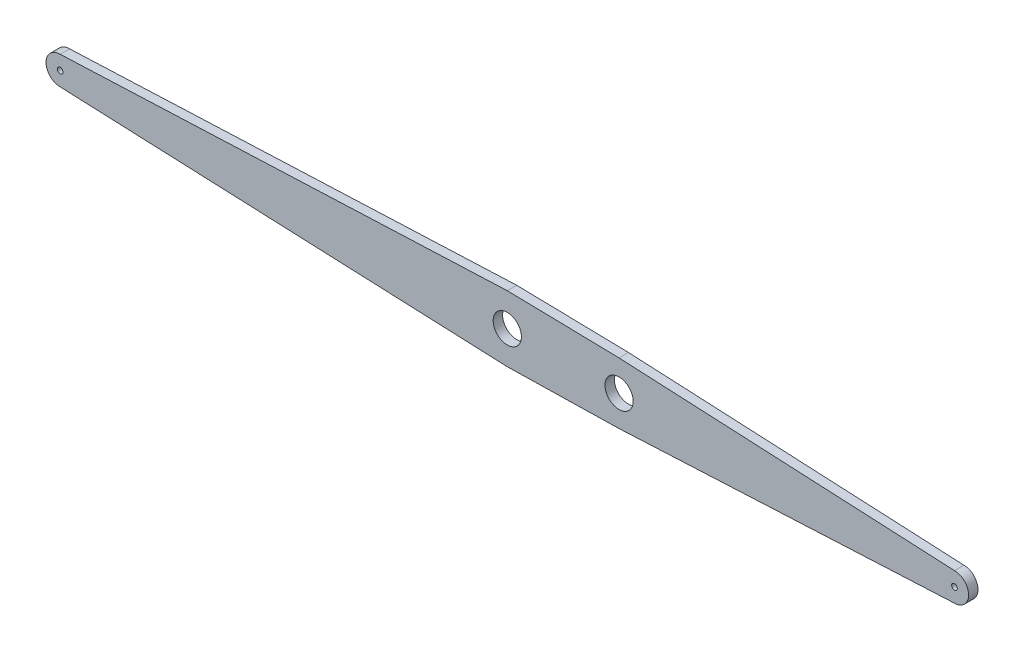
ISO-10303-21;
HEADER;
FILE_DESCRIPTION(('STEP AP214'),'2;1');
FILE_NAME('part.step','',(''),(''),'','','');
FILE_SCHEMA(('AUTOMOTIVE_DESIGN { 1 0 10303 214 1 1 1 1 }'));
ENDSEC;
DATA;
#1=APPLICATION_CONTEXT('core data for automotive mechanical design processes');
#2=APPLICATION_PROTOCOL_DEFINITION('international standard','automotive_design',2000,#1);
#3=PRODUCT_CONTEXT('',#1,'mechanical');
#4=PRODUCT('Part','Part','',(#3));
#5=PRODUCT_RELATED_PRODUCT_CATEGORY('part','',(#4));
#6=PRODUCT_DEFINITION_FORMATION('','',#4);
#7=PRODUCT_DEFINITION_CONTEXT('part definition',#1,'design');
#8=PRODUCT_DEFINITION('design','',#6,#7);
#9=PRODUCT_DEFINITION_SHAPE('','',#8);
#10=(LENGTH_UNIT() NAMED_UNIT(*) SI_UNIT(.MILLI.,.METRE.));
#11=(NAMED_UNIT(*) PLANE_ANGLE_UNIT() SI_UNIT($,.RADIAN.));
#12=(NAMED_UNIT(*) SI_UNIT($,.STERADIAN.) SOLID_ANGLE_UNIT());
#13=UNCERTAINTY_MEASURE_WITH_UNIT(LENGTH_MEASURE(1.E-05),#10,'distance_accuracy_value','');
#14=(GEOMETRIC_REPRESENTATION_CONTEXT(3) GLOBAL_UNCERTAINTY_ASSIGNED_CONTEXT((#13)) GLOBAL_UNIT_ASSIGNED_CONTEXT((#10,
#11,#12)) REPRESENTATION_CONTEXT('',''));
#15=CARTESIAN_POINT('',(0.,0.,0.));
#16=DIRECTION('',(0.,0.,1.));
#17=DIRECTION('',(1.,0.,0.));
#18=AXIS2_PLACEMENT_3D('',#15,#16,#17);
#19=CARTESIAN_POINT('',(0.,0.,20.));
#20=DIRECTION('',(0.,0.,1.));
#21=DIRECTION('',(1.,0.,0.));
#22=AXIS2_PLACEMENT_3D('',#19,#20,#21);
#23=PLANE('',#22);
#24=CARTESIAN_POINT('',(-712.5,0.,20.));
#25=DIRECTION('',(0.,0.,1.));
#26=DIRECTION('',(1.,0.,0.));
#27=AXIS2_PLACEMENT_3D('',#24,#25,#26);
#28=CIRCLE('',#27,30.);
#29=CARTESIAN_POINT('',(-682.5,0.,20.));
#30=VERTEX_POINT('',#29);
#31=EDGE_CURVE('E198',#30,#30,#28,.T.);
#32=ORIENTED_EDGE('',*,*,#31,.F.);
#33=EDGE_LOOP('',(#32));
#34=FACE_BOUND('',#33,.T.);
#35=CARTESIAN_POINT('',(-950.,0.,20.));
#36=DIRECTION('',(0.,0.,1.));
#37=DIRECTION('',(1.,0.,0.));
#38=AXIS2_PLACEMENT_3D('',#35,#36,#37);
#39=CIRCLE('',#38,30.);
#40=CARTESIAN_POINT('',(-920.,0.,20.));
#41=VERTEX_POINT('',#40);
#42=EDGE_CURVE('E144',#41,#41,#39,.T.);
#43=ORIENTED_EDGE('',*,*,#42,.F.);
#44=EDGE_LOOP('',(#43));
#45=FACE_BOUND('',#44,.T.);
#46=DIRECTION('',(-0.999114750296777,-0.0420679894861805,0.));
#47=VECTOR('',#46,1.);
#48=CARTESIAN_POINT('',(-1900.,29.9999999999995,20.));
#49=LINE('',#48,#47);
#50=CARTESIAN_POINT('',(-950.,69.9999999999999,20.));
#51=VERTEX_POINT('',#50);
#52=CARTESIAN_POINT('',(-1900.,29.9999999999998,20.));
#53=VERTEX_POINT('',#52);
#54=EDGE_CURVE('E155',#51,#53,#49,.T.);
#55=ORIENTED_EDGE('',*,*,#54,.T.);
#56=CARTESIAN_POINT('',(-1900.,0.,20.));
#57=DIRECTION('',(0.,0.,1.));
#58=DIRECTION('',(-1.,0.,0.));
#59=AXIS2_PLACEMENT_3D('',#56,#57,#58);
#60=CIRCLE('',#59,29.9999999999998);
#61=CARTESIAN_POINT('',(-1900.,-30.,20.));
#62=VERTEX_POINT('',#61);
#63=EDGE_CURVE('E103',#53,#62,#60,.T.);
#64=ORIENTED_EDGE('',*,*,#63,.T.);
#65=DIRECTION('',(0.999114750296777,-0.0420679894861799,0.));
#66=VECTOR('',#65,1.);
#67=CARTESIAN_POINT('',(-1900.,-30.,20.));
#68=LINE('',#67,#66);
#69=CARTESIAN_POINT('',(-950.,-69.9999999999999,20.));
#70=VERTEX_POINT('',#69);
#71=EDGE_CURVE('E170',#62,#70,#68,.T.);
#72=ORIENTED_EDGE('',*,*,#71,.T.);
#73=DIRECTION('',(0.999778466988863,0.0210479677260812,0.));
#74=VECTOR('',#73,1.);
#75=CARTESIAN_POINT('',(-950.,-69.9999999999999,20.));
#76=LINE('',#75,#74);
#77=CARTESIAN_POINT('',(-712.499999999999,-64.9999999999999,20.));
#78=VERTEX_POINT('',#77);
#79=EDGE_CURVE('E183',#70,#78,#76,.T.);
#80=ORIENTED_EDGE('',*,*,#79,.T.);
#81=DIRECTION('',(0.998795654087924,0.0490636461657225,0.));
#82=VECTOR('',#81,1.);
#83=CARTESIAN_POINT('',(-712.499999999999,-64.9999999999999,20.));
#84=LINE('',#83,#82);
#85=CARTESIAN_POINT('',(0.,-29.9999999999998,20.));
#86=VERTEX_POINT('',#85);
#87=EDGE_CURVE('E122',#78,#86,#84,.T.);
#88=ORIENTED_EDGE('',*,*,#87,.T.);
#89=CARTESIAN_POINT('',(0.,0.,20.));
#90=DIRECTION('',(0.,0.,1.));
#91=DIRECTION('',(1.,0.,0.));
#92=AXIS2_PLACEMENT_3D('',#89,#90,#91);
#93=CIRCLE('',#92,29.9999999999998);
#94=CARTESIAN_POINT('',(0.,29.9999999999995,20.));
#95=VERTEX_POINT('',#94);
#96=EDGE_CURVE('E116',#86,#95,#93,.T.);
#97=ORIENTED_EDGE('',*,*,#96,.T.);
#98=DIRECTION('',(-0.998795654087924,0.0490636461657231,0.));
#99=VECTOR('',#98,1.);
#100=CARTESIAN_POINT('',(-712.5,64.9999999999999,20.));
#101=LINE('',#100,#99);
#102=CARTESIAN_POINT('',(-712.5,64.9999999999999,20.));
#103=VERTEX_POINT('',#102);
#104=EDGE_CURVE('E120',#95,#103,#101,.T.);
#105=ORIENTED_EDGE('',*,*,#104,.T.);
#106=DIRECTION('',(-0.999778466988863,0.0210479677260812,0.));
#107=VECTOR('',#106,1.);
#108=CARTESIAN_POINT('',(-950.,69.9999999999999,20.));
#109=LINE('',#108,#107);
#110=EDGE_CURVE('E60',#103,#51,#109,.T.);
#111=ORIENTED_EDGE('',*,*,#110,.T.);
#112=EDGE_LOOP('',(#55,#64,#72,#80,#88,#97,#105,#111));
#113=FACE_BOUND('',#112,.T.);
#114=CARTESIAN_POINT('',(-1900.,0.,20.));
#115=DIRECTION('',(0.,0.,1.));
#116=DIRECTION('',(1.,0.,0.));
#117=AXIS2_PLACEMENT_3D('',#114,#115,#116);
#118=CIRCLE('',#117,6.0000000000001);
#119=CARTESIAN_POINT('',(-1894.,0.,20.));
#120=VERTEX_POINT('',#119);
#121=EDGE_CURVE('E192',#120,#120,#118,.T.);
#122=ORIENTED_EDGE('',*,*,#121,.F.);
#123=EDGE_LOOP('',(#122));
#124=FACE_BOUND('',#123,.T.);
#125=CARTESIAN_POINT('',(0.,0.,20.));
#126=DIRECTION('',(0.,0.,1.));
#127=DIRECTION('',(1.,0.,0.));
#128=AXIS2_PLACEMENT_3D('',#125,#126,#127);
#129=CIRCLE('',#128,6.);
#130=CARTESIAN_POINT('',(6.,0.,20.));
#131=VERTEX_POINT('',#130);
#132=EDGE_CURVE('E204',#131,#131,#129,.T.);
#133=ORIENTED_EDGE('',*,*,#132,.F.);
#134=EDGE_LOOP('',(#133));
#135=FACE_BOUND('',#134,.T.);
#136=ADVANCED_FACE('F43',(#34,#45,#113,#124,#135),#23,.T.);
#137=CARTESIAN_POINT('',(0.,0.,0.));
#138=DIRECTION('',(0.,0.,1.));
#139=DIRECTION('',(1.,0.,0.));
#140=AXIS2_PLACEMENT_3D('',#137,#138,#139);
#141=PLANE('',#140);
#142=DIRECTION('',(-0.999114750296777,-0.0420679894861805,0.));
#143=VECTOR('',#142,1.);
#144=CARTESIAN_POINT('',(-1900.,29.9999999999995,0.));
#145=LINE('',#144,#143);
#146=CARTESIAN_POINT('',(-950.,69.9999999999999,0.));
#147=VERTEX_POINT('',#146);
#148=CARTESIAN_POINT('',(-1900.,29.9999999999998,0.));
#149=VERTEX_POINT('',#148);
#150=EDGE_CURVE('E140',#147,#149,#145,.T.);
#151=ORIENTED_EDGE('',*,*,#150,.F.);
#152=DIRECTION('',(-0.999778466988863,0.0210479677260812,0.));
#153=VECTOR('',#152,1.);
#154=CARTESIAN_POINT('',(-950.,69.9999999999999,0.));
#155=LINE('',#154,#153);
#156=CARTESIAN_POINT('',(-712.5,64.9999999999999,0.));
#157=VERTEX_POINT('',#156);
#158=EDGE_CURVE('E95',#157,#147,#155,.T.);
#159=ORIENTED_EDGE('',*,*,#158,.F.);
#160=DIRECTION('',(-0.998795654087924,0.0490636461657231,0.));
#161=VECTOR('',#160,1.);
#162=CARTESIAN_POINT('',(-712.5,64.9999999999999,0.));
#163=LINE('',#162,#161);
#164=CARTESIAN_POINT('',(0.,29.9999999999995,0.));
#165=VERTEX_POINT('',#164);
#166=EDGE_CURVE('E89',#165,#157,#163,.T.);
#167=ORIENTED_EDGE('',*,*,#166,.F.);
#168=CARTESIAN_POINT('',(0.,0.,0.));
#169=DIRECTION('',(0.,0.,1.));
#170=DIRECTION('',(1.,0.,0.));
#171=AXIS2_PLACEMENT_3D('',#168,#169,#170);
#172=CIRCLE('',#171,29.9999999999998);
#173=CARTESIAN_POINT('',(0.,-29.9999999999998,0.));
#174=VERTEX_POINT('',#173);
#175=EDGE_CURVE('E130',#174,#165,#172,.T.);
#176=ORIENTED_EDGE('',*,*,#175,.F.);
#177=DIRECTION('',(0.998795654087924,0.0490636461657225,0.));
#178=VECTOR('',#177,1.);
#179=CARTESIAN_POINT('',(-712.499999999999,-64.9999999999999,0.));
#180=LINE('',#179,#178);
#181=CARTESIAN_POINT('',(-712.499999999999,-64.9999999999999,0.));
#182=VERTEX_POINT('',#181);
#183=EDGE_CURVE('E150',#182,#174,#180,.T.);
#184=ORIENTED_EDGE('',*,*,#183,.F.);
#185=DIRECTION('',(0.999778466988863,0.0210479677260812,0.));
#186=VECTOR('',#185,1.);
#187=CARTESIAN_POINT('',(-950.,-69.9999999999999,0.));
#188=LINE('',#187,#186);
#189=CARTESIAN_POINT('',(-950.,-69.9999999999999,0.));
#190=VERTEX_POINT('',#189);
#191=EDGE_CURVE('E148',#190,#182,#188,.T.);
#192=ORIENTED_EDGE('',*,*,#191,.F.);
#193=DIRECTION('',(0.999114750296777,-0.0420679894861799,0.));
#194=VECTOR('',#193,1.);
#195=CARTESIAN_POINT('',(-1900.,-30.,0.));
#196=LINE('',#195,#194);
#197=CARTESIAN_POINT('',(-1900.,-30.,0.));
#198=VERTEX_POINT('',#197);
#199=EDGE_CURVE('E146',#198,#190,#196,.T.);
#200=ORIENTED_EDGE('',*,*,#199,.F.);
#201=CARTESIAN_POINT('',(-1900.,0.,0.));
#202=DIRECTION('',(0.,0.,1.));
#203=DIRECTION('',(-1.,0.,0.));
#204=AXIS2_PLACEMENT_3D('',#201,#202,#203);
#205=CIRCLE('',#204,29.9999999999998);
#206=EDGE_CURVE('E143',#149,#198,#205,.T.);
#207=ORIENTED_EDGE('',*,*,#206,.F.);
#208=EDGE_LOOP('',(#151,#159,#167,#176,#184,#192,#200,#207));
#209=FACE_BOUND('',#208,.T.);
#210=CARTESIAN_POINT('',(-950.,0.,0.));
#211=DIRECTION('',(0.,0.,1.));
#212=DIRECTION('',(1.,0.,0.));
#213=AXIS2_PLACEMENT_3D('',#210,#211,#212);
#214=CIRCLE('',#213,30.);
#215=CARTESIAN_POINT('',(-920.,0.,0.));
#216=VERTEX_POINT('',#215);
#217=EDGE_CURVE('E189',#216,#216,#214,.T.);
#218=ORIENTED_EDGE('',*,*,#217,.T.);
#219=EDGE_LOOP('',(#218));
#220=FACE_BOUND('',#219,.T.);
#221=CARTESIAN_POINT('',(-1900.,0.,0.));
#222=DIRECTION('',(0.,0.,1.));
#223=DIRECTION('',(1.,0.,0.));
#224=AXIS2_PLACEMENT_3D('',#221,#222,#223);
#225=CIRCLE('',#224,6.0000000000001);
#226=CARTESIAN_POINT('',(-1894.,0.,0.));
#227=VERTEX_POINT('',#226);
#228=EDGE_CURVE('E195',#227,#227,#225,.T.);
#229=ORIENTED_EDGE('',*,*,#228,.T.);
#230=EDGE_LOOP('',(#229));
#231=FACE_BOUND('',#230,.T.);
#232=CARTESIAN_POINT('',(-712.5,0.,0.));
#233=DIRECTION('',(0.,0.,1.));
#234=DIRECTION('',(1.,0.,0.));
#235=AXIS2_PLACEMENT_3D('',#232,#233,#234);
#236=CIRCLE('',#235,30.);
#237=CARTESIAN_POINT('',(-682.5,0.,0.));
#238=VERTEX_POINT('',#237);
#239=EDGE_CURVE('E201',#238,#238,#236,.T.);
#240=ORIENTED_EDGE('',*,*,#239,.T.);
#241=EDGE_LOOP('',(#240));
#242=FACE_BOUND('',#241,.T.);
#243=CARTESIAN_POINT('',(0.,0.,0.));
#244=DIRECTION('',(0.,0.,1.));
#245=DIRECTION('',(1.,0.,0.));
#246=AXIS2_PLACEMENT_3D('',#243,#244,#245);
#247=CIRCLE('',#246,6.);
#248=CARTESIAN_POINT('',(6.,0.,0.));
#249=VERTEX_POINT('',#248);
#250=EDGE_CURVE('E207',#249,#249,#247,.T.);
#251=ORIENTED_EDGE('',*,*,#250,.T.);
#252=EDGE_LOOP('',(#251));
#253=FACE_BOUND('',#252,.T.);
#254=ADVANCED_FACE('F174',(#209,#220,#231,#242,#253),#141,.F.);
#255=CARTESIAN_POINT('',(-1900.,29.9999999999995,20.));
#256=DIRECTION('',(0.0420679894861805,-0.999114750296777,0.));
#257=DIRECTION('',(0.999114750296777,0.0420679894861805,0.));
#258=AXIS2_PLACEMENT_3D('',#255,#256,#257);
#259=PLANE('',#258);
#260=ORIENTED_EDGE('',*,*,#150,.T.);
#261=DIRECTION('',(0.,0.,-1.));
#262=VECTOR('',#261,1.);
#263=CARTESIAN_POINT('',(-1900.,29.9999999999998,20.));
#264=LINE('',#263,#262);
#265=EDGE_CURVE('E13',#53,#149,#264,.T.);
#266=ORIENTED_EDGE('',*,*,#265,.F.);
#267=ORIENTED_EDGE('',*,*,#54,.F.);
#268=DIRECTION('',(0.,0.,-1.));
#269=VECTOR('',#268,1.);
#270=CARTESIAN_POINT('',(-950.,69.9999999999999,20.));
#271=LINE('',#270,#269);
#272=EDGE_CURVE('E136',#51,#147,#271,.T.);
#273=ORIENTED_EDGE('',*,*,#272,.T.);
#274=EDGE_LOOP('',(#260,#266,#267,#273));
#275=FACE_BOUND('',#274,.T.);
#276=ADVANCED_FACE('F45',(#275),#259,.F.);
#277=CARTESIAN_POINT('',(-1900.,0.,20.));
#278=DIRECTION('',(0.,0.,-1.));
#279=DIRECTION('',(-1.,0.,0.));
#280=AXIS2_PLACEMENT_3D('',#277,#278,#279);
#281=CYLINDRICAL_SURFACE('',#280,29.9999999999998);
#282=ORIENTED_EDGE('',*,*,#206,.T.);
#283=DIRECTION('',(0.,0.,-1.));
#284=VECTOR('',#283,1.);
#285=CARTESIAN_POINT('',(-1900.,-30.,20.));
#286=LINE('',#285,#284);
#287=EDGE_CURVE('E52',#62,#198,#286,.T.);
#288=ORIENTED_EDGE('',*,*,#287,.F.);
#289=ORIENTED_EDGE('',*,*,#63,.F.);
#290=ORIENTED_EDGE('',*,*,#265,.T.);
#291=EDGE_LOOP('',(#282,#288,#289,#290));
#292=FACE_BOUND('',#291,.T.);
#293=ADVANCED_FACE('F241',(#292),#281,.T.);
#294=CARTESIAN_POINT('',(-1900.,-30.,20.));
#295=DIRECTION('',(0.0420679894861799,0.999114750296777,0.));
#296=DIRECTION('',(-0.999114750296777,0.0420679894861799,0.));
#297=AXIS2_PLACEMENT_3D('',#294,#295,#296);
#298=PLANE('',#297);
#299=ORIENTED_EDGE('',*,*,#199,.T.);
#300=DIRECTION('',(0.,0.,-1.));
#301=VECTOR('',#300,1.);
#302=CARTESIAN_POINT('',(-950.,-69.9999999999999,20.));
#303=LINE('',#302,#301);
#304=EDGE_CURVE('E162',#70,#190,#303,.T.);
#305=ORIENTED_EDGE('',*,*,#304,.F.);
#306=ORIENTED_EDGE('',*,*,#71,.F.);
#307=ORIENTED_EDGE('',*,*,#287,.T.);
#308=EDGE_LOOP('',(#299,#305,#306,#307));
#309=FACE_BOUND('',#308,.T.);
#310=ADVANCED_FACE('F168',(#309),#298,.F.);
#311=CARTESIAN_POINT('',(-950.,-69.9999999999999,20.));
#312=DIRECTION('',(-0.0210479677260812,0.999778466988863,0.));
#313=DIRECTION('',(-0.999778466988864,-0.0210479677260812,0.));
#314=AXIS2_PLACEMENT_3D('',#311,#312,#313);
#315=PLANE('',#314);
#316=ORIENTED_EDGE('',*,*,#191,.T.);
#317=DIRECTION('',(0.,0.,-1.));
#318=VECTOR('',#317,1.);
#319=CARTESIAN_POINT('',(-712.499999999999,-64.9999999999999,20.));
#320=LINE('',#319,#318);
#321=EDGE_CURVE('E159',#78,#182,#320,.T.);
#322=ORIENTED_EDGE('',*,*,#321,.F.);
#323=ORIENTED_EDGE('',*,*,#79,.F.);
#324=ORIENTED_EDGE('',*,*,#304,.T.);
#325=EDGE_LOOP('',(#316,#322,#323,#324));
#326=FACE_BOUND('',#325,.T.);
#327=ADVANCED_FACE('F179',(#326),#315,.F.);
#328=CARTESIAN_POINT('',(-712.499999999999,-64.9999999999999,20.));
#329=DIRECTION('',(-0.0490636461657225,0.998795654087924,0.));
#330=DIRECTION('',(-0.998795654087925,-0.0490636461657225,0.));
#331=AXIS2_PLACEMENT_3D('',#328,#329,#330);
#332=PLANE('',#331);
#333=ORIENTED_EDGE('',*,*,#183,.T.);
#334=DIRECTION('',(0.,0.,-1.));
#335=VECTOR('',#334,1.);
#336=CARTESIAN_POINT('',(0.,-29.9999999999998,20.));
#337=LINE('',#336,#335);
#338=EDGE_CURVE('E131',#86,#174,#337,.T.);
#339=ORIENTED_EDGE('',*,*,#338,.F.);
#340=ORIENTED_EDGE('',*,*,#87,.F.);
#341=ORIENTED_EDGE('',*,*,#321,.T.);
#342=EDGE_LOOP('',(#333,#339,#340,#341));
#343=FACE_BOUND('',#342,.T.);
#344=ADVANCED_FACE('F182',(#343),#332,.F.);
#345=CARTESIAN_POINT('',(0.,0.,20.));
#346=DIRECTION('',(0.,0.,-1.));
#347=DIRECTION('',(-1.,0.,0.));
#348=AXIS2_PLACEMENT_3D('',#345,#346,#347);
#349=CYLINDRICAL_SURFACE('',#348,29.9999999999998);
#350=ORIENTED_EDGE('',*,*,#175,.T.);
#351=DIRECTION('',(0.,0.,-1.));
#352=VECTOR('',#351,1.);
#353=CARTESIAN_POINT('',(0.,29.9999999999995,20.));
#354=LINE('',#353,#352);
#355=EDGE_CURVE('E127',#95,#165,#354,.T.);
#356=ORIENTED_EDGE('',*,*,#355,.F.);
#357=ORIENTED_EDGE('',*,*,#96,.F.);
#358=ORIENTED_EDGE('',*,*,#338,.T.);
#359=EDGE_LOOP('',(#350,#356,#357,#358));
#360=FACE_BOUND('',#359,.T.);
#361=ADVANCED_FACE('F128',(#360),#349,.T.);
#362=CARTESIAN_POINT('',(-712.5,64.9999999999999,20.));
#363=DIRECTION('',(-0.0490636461657231,-0.998795654087924,0.));
#364=DIRECTION('',(0.998795654087924,-0.0490636461657231,0.));
#365=AXIS2_PLACEMENT_3D('',#362,#363,#364);
#366=PLANE('',#365);
#367=ORIENTED_EDGE('',*,*,#166,.T.);
#368=DIRECTION('',(0.,0.,-1.));
#369=VECTOR('',#368,1.);
#370=CARTESIAN_POINT('',(-712.5,64.9999999999999,20.));
#371=LINE('',#370,#369);
#372=EDGE_CURVE('E132',#103,#157,#371,.T.);
#373=ORIENTED_EDGE('',*,*,#372,.F.);
#374=ORIENTED_EDGE('',*,*,#104,.F.);
#375=ORIENTED_EDGE('',*,*,#355,.T.);
#376=EDGE_LOOP('',(#367,#373,#374,#375));
#377=FACE_BOUND('',#376,.T.);
#378=ADVANCED_FACE('F134',(#377),#366,.F.);
#379=CARTESIAN_POINT('',(-950.,69.9999999999999,20.));
#380=DIRECTION('',(-0.0210479677260812,-0.999778466988863,0.));
#381=DIRECTION('',(0.999778466988864,-0.0210479677260812,0.));
#382=AXIS2_PLACEMENT_3D('',#379,#380,#381);
#383=PLANE('',#382);
#384=ORIENTED_EDGE('',*,*,#158,.T.);
#385=ORIENTED_EDGE('',*,*,#272,.F.);
#386=ORIENTED_EDGE('',*,*,#110,.F.);
#387=ORIENTED_EDGE('',*,*,#372,.T.);
#388=EDGE_LOOP('',(#384,#385,#386,#387));
#389=FACE_BOUND('',#388,.T.);
#390=ADVANCED_FACE('F229',(#389),#383,.F.);
#391=CARTESIAN_POINT('',(-950.,0.,20.));
#392=DIRECTION('',(0.,0.,-1.));
#393=DIRECTION('',(-1.,0.,0.));
#394=AXIS2_PLACEMENT_3D('',#391,#392,#393);
#395=CYLINDRICAL_SURFACE('',#394,30.);
#396=ORIENTED_EDGE('',*,*,#42,.T.);
#397=EDGE_LOOP('',(#396));
#398=FACE_BOUND('',#397,.T.);
#399=ORIENTED_EDGE('',*,*,#217,.F.);
#400=EDGE_LOOP('',(#399));
#401=FACE_BOUND('',#400,.T.);
#402=ADVANCED_FACE('F226',(#398,#401),#395,.F.);
#403=CARTESIAN_POINT('',(-1900.,0.,20.));
#404=DIRECTION('',(0.,0.,-1.));
#405=DIRECTION('',(-1.,0.,0.));
#406=AXIS2_PLACEMENT_3D('',#403,#404,#405);
#407=CYLINDRICAL_SURFACE('',#406,6.0000000000001);
#408=ORIENTED_EDGE('',*,*,#121,.T.);
#409=EDGE_LOOP('',(#408));
#410=FACE_BOUND('',#409,.T.);
#411=ORIENTED_EDGE('',*,*,#228,.F.);
#412=EDGE_LOOP('',(#411));
#413=FACE_BOUND('',#412,.T.);
#414=ADVANCED_FACE('F305',(#410,#413),#407,.F.);
#415=CARTESIAN_POINT('',(-712.5,0.,20.));
#416=DIRECTION('',(0.,0.,-1.));
#417=DIRECTION('',(-1.,0.,0.));
#418=AXIS2_PLACEMENT_3D('',#415,#416,#417);
#419=CYLINDRICAL_SURFACE('',#418,30.);
#420=ORIENTED_EDGE('',*,*,#31,.T.);
#421=EDGE_LOOP('',(#420));
#422=FACE_BOUND('',#421,.T.);
#423=ORIENTED_EDGE('',*,*,#239,.F.);
#424=EDGE_LOOP('',(#423));
#425=FACE_BOUND('',#424,.T.);
#426=ADVANCED_FACE('F313',(#422,#425),#419,.F.);
#427=CARTESIAN_POINT('',(0.,0.,20.));
#428=DIRECTION('',(0.,0.,-1.));
#429=DIRECTION('',(-1.,0.,0.));
#430=AXIS2_PLACEMENT_3D('',#427,#428,#429);
#431=CYLINDRICAL_SURFACE('',#430,6.);
#432=ORIENTED_EDGE('',*,*,#132,.T.);
#433=EDGE_LOOP('',(#432));
#434=FACE_BOUND('',#433,.T.);
#435=ORIENTED_EDGE('',*,*,#250,.F.);
#436=EDGE_LOOP('',(#435));
#437=FACE_BOUND('',#436,.T.);
#438=ADVANCED_FACE('F213',(#434,#437),#431,.F.);
#439=CLOSED_SHELL('',(#136,#254,#276,#293,#310,#327,#344,#361,#378,#390,#402,#414,#426,#438));
#440=MANIFOLD_SOLID_BREP('B2',#439);
#441=ADVANCED_BREP_SHAPE_REPRESENTATION('',(#18,#440),#14);
#442=SHAPE_DEFINITION_REPRESENTATION(#9,#441);
ENDSEC;
END-ISO-10303-21;
